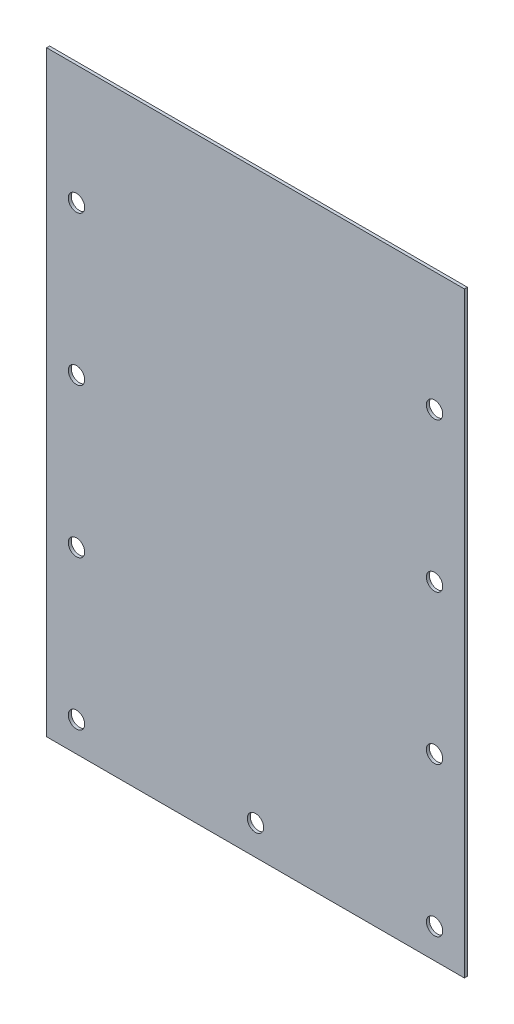
ISO-10303-21;
HEADER;
FILE_DESCRIPTION(('STEP AP214'),'2;1');
FILE_NAME('part.step','',(''),(''),'','','');
FILE_SCHEMA(('AUTOMOTIVE_DESIGN { 1 0 10303 214 1 1 1 1 }'));
ENDSEC;
DATA;
#1=APPLICATION_CONTEXT('core data for automotive mechanical design processes');
#2=APPLICATION_PROTOCOL_DEFINITION('international standard','automotive_design',2000,#1);
#3=PRODUCT_CONTEXT('',#1,'mechanical');
#4=PRODUCT('Part','Part','',(#3));
#5=PRODUCT_RELATED_PRODUCT_CATEGORY('part','',(#4));
#6=PRODUCT_DEFINITION_FORMATION('','',#4);
#7=PRODUCT_DEFINITION_CONTEXT('part definition',#1,'design');
#8=PRODUCT_DEFINITION('design','',#6,#7);
#9=PRODUCT_DEFINITION_SHAPE('','',#8);
#10=(LENGTH_UNIT() NAMED_UNIT(*) SI_UNIT(.MILLI.,.METRE.));
#11=(NAMED_UNIT(*) PLANE_ANGLE_UNIT() SI_UNIT($,.RADIAN.));
#12=(NAMED_UNIT(*) SI_UNIT($,.STERADIAN.) SOLID_ANGLE_UNIT());
#13=UNCERTAINTY_MEASURE_WITH_UNIT(LENGTH_MEASURE(1.E-05),#10,'distance_accuracy_value','');
#14=(GEOMETRIC_REPRESENTATION_CONTEXT(3) GLOBAL_UNCERTAINTY_ASSIGNED_CONTEXT((#13)) GLOBAL_UNIT_ASSIGNED_CONTEXT((#10,
#11,#12)) REPRESENTATION_CONTEXT('',''));
#15=CARTESIAN_POINT('',(0.,0.,0.));
#16=DIRECTION('',(0.,0.,1.));
#17=DIRECTION('',(1.,0.,0.));
#18=AXIS2_PLACEMENT_3D('',#15,#16,#17);
#19=CARTESIAN_POINT('',(-70.,-110.,1.));
#20=DIRECTION('',(-1.,0.,0.));
#21=DIRECTION('',(0.,0.,1.));
#22=AXIS2_PLACEMENT_3D('',#19,#20,#21);
#23=PLANE('',#22);
#24=DIRECTION('',(0.,0.,-1.));
#25=VECTOR('',#24,1.);
#26=CARTESIAN_POINT('',(-70.,90.,10.));
#27=LINE('',#26,#25);
#28=CARTESIAN_POINT('',(-70.,90.,0.999999999999999));
#29=VERTEX_POINT('',#28);
#30=CARTESIAN_POINT('',(-70.,90.,0.));
#31=VERTEX_POINT('',#30);
#32=EDGE_CURVE('E89',#29,#31,#27,.T.);
#33=ORIENTED_EDGE('',*,*,#32,.T.);
#34=DIRECTION('',(0.,1.,0.));
#35=VECTOR('',#34,1.);
#36=CARTESIAN_POINT('',(-70.,-110.,0.));
#37=LINE('',#36,#35);
#38=CARTESIAN_POINT('',(-70.,-110.,0.));
#39=VERTEX_POINT('',#38);
#40=EDGE_CURVE('E82',#39,#31,#37,.T.);
#41=ORIENTED_EDGE('',*,*,#40,.F.);
#42=DIRECTION('',(0.,0.,-1.));
#43=VECTOR('',#42,1.);
#44=CARTESIAN_POINT('',(-70.,-110.,1.));
#45=LINE('',#44,#43);
#46=CARTESIAN_POINT('',(-70.,-110.,1.));
#47=VERTEX_POINT('',#46);
#48=EDGE_CURVE('E11',#47,#39,#45,.T.);
#49=ORIENTED_EDGE('',*,*,#48,.F.);
#50=DIRECTION('',(0.,1.,0.));
#51=VECTOR('',#50,1.);
#52=CARTESIAN_POINT('',(-70.,-110.,1.));
#53=LINE('',#52,#51);
#54=EDGE_CURVE('E85',#47,#29,#53,.T.);
#55=ORIENTED_EDGE('',*,*,#54,.T.);
#56=EDGE_LOOP('',(#33,#41,#49,#55));
#57=FACE_BOUND('',#56,.T.);
#58=ADVANCED_FACE('F37',(#57),#23,.T.);
#59=CARTESIAN_POINT('',(-70.,-110.,1.));
#60=DIRECTION('',(0.,1.,0.));
#61=DIRECTION('',(0.,0.,1.));
#62=AXIS2_PLACEMENT_3D('',#59,#60,#61);
#63=PLANE('',#62);
#64=DIRECTION('',(1.,0.,0.));
#65=VECTOR('',#64,1.);
#66=CARTESIAN_POINT('',(-70.,-110.,0.));
#67=LINE('',#66,#65);
#68=CARTESIAN_POINT('',(70.,-110.,0.));
#69=VERTEX_POINT('',#68);
#70=EDGE_CURVE('E72',#39,#69,#67,.T.);
#71=ORIENTED_EDGE('',*,*,#70,.T.);
#72=DIRECTION('',(0.,0.,-1.));
#73=VECTOR('',#72,1.);
#74=CARTESIAN_POINT('',(70.,-110.,1.));
#75=LINE('',#74,#73);
#76=CARTESIAN_POINT('',(70.,-110.,1.));
#77=VERTEX_POINT('',#76);
#78=EDGE_CURVE('E40',#77,#69,#75,.T.);
#79=ORIENTED_EDGE('',*,*,#78,.F.);
#80=DIRECTION('',(1.,0.,0.));
#81=VECTOR('',#80,1.);
#82=CARTESIAN_POINT('',(-70.,-110.,1.));
#83=LINE('',#82,#81);
#84=EDGE_CURVE('E74',#47,#77,#83,.T.);
#85=ORIENTED_EDGE('',*,*,#84,.F.);
#86=ORIENTED_EDGE('',*,*,#48,.T.);
#87=EDGE_LOOP('',(#71,#79,#85,#86));
#88=FACE_BOUND('',#87,.T.);
#89=ADVANCED_FACE('F70',(#88),#63,.F.);
#90=CARTESIAN_POINT('',(70.,-110.,1.));
#91=DIRECTION('',(-1.,0.,0.));
#92=DIRECTION('',(0.,0.,1.));
#93=AXIS2_PLACEMENT_3D('',#90,#91,#92);
#94=PLANE('',#93);
#95=DIRECTION('',(0.,1.,0.));
#96=VECTOR('',#95,1.);
#97=CARTESIAN_POINT('',(70.,-110.,0.));
#98=LINE('',#97,#96);
#99=CARTESIAN_POINT('',(70.,90.,0.));
#100=VERTEX_POINT('',#99);
#101=EDGE_CURVE('E84',#69,#100,#98,.T.);
#102=ORIENTED_EDGE('',*,*,#101,.T.);
#103=DIRECTION('',(0.,0.,-1.));
#104=VECTOR('',#103,1.);
#105=CARTESIAN_POINT('',(70.,90.,10.));
#106=LINE('',#105,#104);
#107=CARTESIAN_POINT('',(70.,90.,0.999999999999999));
#108=VERTEX_POINT('',#107);
#109=EDGE_CURVE('E51',#108,#100,#106,.T.);
#110=ORIENTED_EDGE('',*,*,#109,.F.);
#111=DIRECTION('',(0.,1.,0.));
#112=VECTOR('',#111,1.);
#113=CARTESIAN_POINT('',(70.,-110.,1.));
#114=LINE('',#113,#112);
#115=EDGE_CURVE('E98',#77,#108,#114,.T.);
#116=ORIENTED_EDGE('',*,*,#115,.F.);
#117=ORIENTED_EDGE('',*,*,#78,.T.);
#118=EDGE_LOOP('',(#102,#110,#116,#117));
#119=FACE_BOUND('',#118,.T.);
#120=ADVANCED_FACE('F162',(#119),#94,.F.);
#121=CARTESIAN_POINT('',(0.,0.,1.));
#122=DIRECTION('',(0.,0.,-1.));
#123=DIRECTION('',(-1.,0.,0.));
#124=AXIS2_PLACEMENT_3D('',#121,#122,#123);
#125=PLANE('',#124);
#126=CARTESIAN_POINT('',(-60.,50.,1.));
#127=DIRECTION('',(0.,0.,-1.));
#128=DIRECTION('',(-1.,0.,0.));
#129=AXIS2_PLACEMENT_3D('',#126,#127,#128);
#130=CIRCLE('',#129,2.75);
#131=CARTESIAN_POINT('',(-62.75,50.,1.));
#132=VERTEX_POINT('',#131);
#133=EDGE_CURVE('E146',#132,#132,#130,.T.);
#134=ORIENTED_EDGE('',*,*,#133,.T.);
#135=EDGE_LOOP('',(#134));
#136=FACE_BOUND('',#135,.T.);
#137=CARTESIAN_POINT('',(-60.,-50.,1.));
#138=DIRECTION('',(0.,0.,-1.));
#139=DIRECTION('',(-1.,0.,0.));
#140=AXIS2_PLACEMENT_3D('',#137,#138,#139);
#141=CIRCLE('',#140,2.75);
#142=CARTESIAN_POINT('',(-62.75,-50.,1.));
#143=VERTEX_POINT('',#142);
#144=EDGE_CURVE('E140',#143,#143,#141,.T.);
#145=ORIENTED_EDGE('',*,*,#144,.T.);
#146=EDGE_LOOP('',(#145));
#147=FACE_BOUND('',#146,.T.);
#148=CARTESIAN_POINT('',(-60.,0.,1.));
#149=DIRECTION('',(0.,0.,-1.));
#150=DIRECTION('',(-1.,0.,0.));
#151=AXIS2_PLACEMENT_3D('',#148,#149,#150);
#152=CIRCLE('',#151,2.75);
#153=CARTESIAN_POINT('',(-62.75,0.,1.));
#154=VERTEX_POINT('',#153);
#155=EDGE_CURVE('E134',#154,#154,#152,.T.);
#156=ORIENTED_EDGE('',*,*,#155,.T.);
#157=EDGE_LOOP('',(#156));
#158=FACE_BOUND('',#157,.T.);
#159=CARTESIAN_POINT('',(-60.,-100.,1.));
#160=DIRECTION('',(0.,0.,-1.));
#161=DIRECTION('',(-1.,0.,0.));
#162=AXIS2_PLACEMENT_3D('',#159,#160,#161);
#163=CIRCLE('',#162,2.75);
#164=CARTESIAN_POINT('',(-62.75,-100.,1.));
#165=VERTEX_POINT('',#164);
#166=EDGE_CURVE('E128',#165,#165,#163,.T.);
#167=ORIENTED_EDGE('',*,*,#166,.T.);
#168=EDGE_LOOP('',(#167));
#169=FACE_BOUND('',#168,.T.);
#170=CARTESIAN_POINT('',(60.,50.,1.));
#171=DIRECTION('',(0.,0.,-1.));
#172=DIRECTION('',(-1.,0.,0.));
#173=AXIS2_PLACEMENT_3D('',#170,#171,#172);
#174=CIRCLE('',#173,2.75);
#175=CARTESIAN_POINT('',(57.25,50.,1.));
#176=VERTEX_POINT('',#175);
#177=EDGE_CURVE('E122',#176,#176,#174,.T.);
#178=ORIENTED_EDGE('',*,*,#177,.T.);
#179=EDGE_LOOP('',(#178));
#180=FACE_BOUND('',#179,.T.);
#181=CARTESIAN_POINT('',(60.,-50.,1.));
#182=DIRECTION('',(0.,0.,-1.));
#183=DIRECTION('',(-1.,0.,0.));
#184=AXIS2_PLACEMENT_3D('',#181,#182,#183);
#185=CIRCLE('',#184,2.75);
#186=CARTESIAN_POINT('',(57.25,-50.,1.));
#187=VERTEX_POINT('',#186);
#188=EDGE_CURVE('E116',#187,#187,#185,.T.);
#189=ORIENTED_EDGE('',*,*,#188,.T.);
#190=EDGE_LOOP('',(#189));
#191=FACE_BOUND('',#190,.T.);
#192=CARTESIAN_POINT('',(60.,0.,1.));
#193=DIRECTION('',(0.,0.,-1.));
#194=DIRECTION('',(-1.,0.,0.));
#195=AXIS2_PLACEMENT_3D('',#192,#193,#194);
#196=CIRCLE('',#195,2.75);
#197=CARTESIAN_POINT('',(57.25,0.,1.));
#198=VERTEX_POINT('',#197);
#199=EDGE_CURVE('E110',#198,#198,#196,.T.);
#200=ORIENTED_EDGE('',*,*,#199,.T.);
#201=EDGE_LOOP('',(#200));
#202=FACE_BOUND('',#201,.T.);
#203=CARTESIAN_POINT('',(60.,-100.,1.));
#204=DIRECTION('',(0.,0.,-1.));
#205=DIRECTION('',(-1.,0.,0.));
#206=AXIS2_PLACEMENT_3D('',#203,#204,#205);
#207=CIRCLE('',#206,2.75);
#208=CARTESIAN_POINT('',(57.25,-100.,1.));
#209=VERTEX_POINT('',#208);
#210=EDGE_CURVE('E104',#209,#209,#207,.T.);
#211=ORIENTED_EDGE('',*,*,#210,.T.);
#212=EDGE_LOOP('',(#211));
#213=FACE_BOUND('',#212,.T.);
#214=CARTESIAN_POINT('',(0.,-100.,1.));
#215=DIRECTION('',(0.,0.,-1.));
#216=DIRECTION('',(-1.,0.,0.));
#217=AXIS2_PLACEMENT_3D('',#214,#215,#216);
#218=CIRCLE('',#217,2.75);
#219=CARTESIAN_POINT('',(-2.74999999999999,-100.,1.));
#220=VERTEX_POINT('',#219);
#221=EDGE_CURVE('E90',#220,#220,#218,.T.);
#222=ORIENTED_EDGE('',*,*,#221,.T.);
#223=EDGE_LOOP('',(#222));
#224=FACE_BOUND('',#223,.T.);
#225=ORIENTED_EDGE('',*,*,#115,.T.);
#226=DIRECTION('',(-1.,0.,0.));
#227=VECTOR('',#226,1.);
#228=CARTESIAN_POINT('',(0.,90.,1.));
#229=LINE('',#228,#227);
#230=EDGE_CURVE('E152',#108,#29,#229,.T.);
#231=ORIENTED_EDGE('',*,*,#230,.T.);
#232=ORIENTED_EDGE('',*,*,#54,.F.);
#233=ORIENTED_EDGE('',*,*,#84,.T.);
#234=EDGE_LOOP('',(#225,#231,#232,#233));
#235=FACE_BOUND('',#234,.T.);
#236=ADVANCED_FACE('F165',(#136,#147,#158,#169,#180,#191,#202,#213,#224,#235),#125,.F.);
#237=CARTESIAN_POINT('',(0.,0.,0.));
#238=DIRECTION('',(0.,0.,-1.));
#239=DIRECTION('',(-1.,0.,0.));
#240=AXIS2_PLACEMENT_3D('',#237,#238,#239);
#241=PLANE('',#240);
#242=DIRECTION('',(-1.,0.,0.));
#243=VECTOR('',#242,1.);
#244=CARTESIAN_POINT('',(70.,90.,0.));
#245=LINE('',#244,#243);
#246=EDGE_CURVE('E156',#100,#31,#245,.T.);
#247=ORIENTED_EDGE('',*,*,#246,.F.);
#248=ORIENTED_EDGE('',*,*,#101,.F.);
#249=ORIENTED_EDGE('',*,*,#70,.F.);
#250=ORIENTED_EDGE('',*,*,#40,.T.);
#251=EDGE_LOOP('',(#247,#248,#249,#250));
#252=FACE_BOUND('',#251,.T.);
#253=CARTESIAN_POINT('',(-60.,50.,0.));
#254=DIRECTION('',(0.,0.,-1.));
#255=DIRECTION('',(-1.,0.,0.));
#256=AXIS2_PLACEMENT_3D('',#253,#254,#255);
#257=CIRCLE('',#256,2.75);
#258=CARTESIAN_POINT('',(-62.75,50.,0.));
#259=VERTEX_POINT('',#258);
#260=EDGE_CURVE('E149',#259,#259,#257,.T.);
#261=ORIENTED_EDGE('',*,*,#260,.F.);
#262=EDGE_LOOP('',(#261));
#263=FACE_BOUND('',#262,.T.);
#264=CARTESIAN_POINT('',(-60.,-50.,0.));
#265=DIRECTION('',(0.,0.,-1.));
#266=DIRECTION('',(-1.,0.,0.));
#267=AXIS2_PLACEMENT_3D('',#264,#265,#266);
#268=CIRCLE('',#267,2.75);
#269=CARTESIAN_POINT('',(-62.75,-50.,0.));
#270=VERTEX_POINT('',#269);
#271=EDGE_CURVE('E143',#270,#270,#268,.T.);
#272=ORIENTED_EDGE('',*,*,#271,.F.);
#273=EDGE_LOOP('',(#272));
#274=FACE_BOUND('',#273,.T.);
#275=CARTESIAN_POINT('',(-60.,0.,0.));
#276=DIRECTION('',(0.,0.,-1.));
#277=DIRECTION('',(-1.,0.,0.));
#278=AXIS2_PLACEMENT_3D('',#275,#276,#277);
#279=CIRCLE('',#278,2.75);
#280=CARTESIAN_POINT('',(-62.75,0.,0.));
#281=VERTEX_POINT('',#280);
#282=EDGE_CURVE('E137',#281,#281,#279,.T.);
#283=ORIENTED_EDGE('',*,*,#282,.F.);
#284=EDGE_LOOP('',(#283));
#285=FACE_BOUND('',#284,.T.);
#286=CARTESIAN_POINT('',(-60.,-100.,0.));
#287=DIRECTION('',(0.,0.,-1.));
#288=DIRECTION('',(-1.,0.,0.));
#289=AXIS2_PLACEMENT_3D('',#286,#287,#288);
#290=CIRCLE('',#289,2.75);
#291=CARTESIAN_POINT('',(-62.75,-100.,0.));
#292=VERTEX_POINT('',#291);
#293=EDGE_CURVE('E131',#292,#292,#290,.T.);
#294=ORIENTED_EDGE('',*,*,#293,.F.);
#295=EDGE_LOOP('',(#294));
#296=FACE_BOUND('',#295,.T.);
#297=CARTESIAN_POINT('',(60.,50.,0.));
#298=DIRECTION('',(0.,0.,-1.));
#299=DIRECTION('',(-1.,0.,0.));
#300=AXIS2_PLACEMENT_3D('',#297,#298,#299);
#301=CIRCLE('',#300,2.75);
#302=CARTESIAN_POINT('',(57.25,50.,0.));
#303=VERTEX_POINT('',#302);
#304=EDGE_CURVE('E125',#303,#303,#301,.T.);
#305=ORIENTED_EDGE('',*,*,#304,.F.);
#306=EDGE_LOOP('',(#305));
#307=FACE_BOUND('',#306,.T.);
#308=CARTESIAN_POINT('',(60.,-50.,0.));
#309=DIRECTION('',(0.,0.,-1.));
#310=DIRECTION('',(-1.,0.,0.));
#311=AXIS2_PLACEMENT_3D('',#308,#309,#310);
#312=CIRCLE('',#311,2.75);
#313=CARTESIAN_POINT('',(57.25,-50.,0.));
#314=VERTEX_POINT('',#313);
#315=EDGE_CURVE('E119',#314,#314,#312,.T.);
#316=ORIENTED_EDGE('',*,*,#315,.F.);
#317=EDGE_LOOP('',(#316));
#318=FACE_BOUND('',#317,.T.);
#319=CARTESIAN_POINT('',(60.,0.,0.));
#320=DIRECTION('',(0.,0.,-1.));
#321=DIRECTION('',(-1.,0.,0.));
#322=AXIS2_PLACEMENT_3D('',#319,#320,#321);
#323=CIRCLE('',#322,2.75);
#324=CARTESIAN_POINT('',(57.25,0.,0.));
#325=VERTEX_POINT('',#324);
#326=EDGE_CURVE('E113',#325,#325,#323,.T.);
#327=ORIENTED_EDGE('',*,*,#326,.F.);
#328=EDGE_LOOP('',(#327));
#329=FACE_BOUND('',#328,.T.);
#330=CARTESIAN_POINT('',(60.,-100.,0.));
#331=DIRECTION('',(0.,0.,-1.));
#332=DIRECTION('',(-1.,0.,0.));
#333=AXIS2_PLACEMENT_3D('',#330,#331,#332);
#334=CIRCLE('',#333,2.75);
#335=CARTESIAN_POINT('',(57.25,-100.,0.));
#336=VERTEX_POINT('',#335);
#337=EDGE_CURVE('E107',#336,#336,#334,.T.);
#338=ORIENTED_EDGE('',*,*,#337,.F.);
#339=EDGE_LOOP('',(#338));
#340=FACE_BOUND('',#339,.T.);
#341=CARTESIAN_POINT('',(0.,-100.,0.));
#342=DIRECTION('',(0.,0.,-1.));
#343=DIRECTION('',(-1.,0.,0.));
#344=AXIS2_PLACEMENT_3D('',#341,#342,#343);
#345=CIRCLE('',#344,2.75);
#346=CARTESIAN_POINT('',(-2.74999999999999,-100.,0.));
#347=VERTEX_POINT('',#346);
#348=EDGE_CURVE('E94',#347,#347,#345,.T.);
#349=ORIENTED_EDGE('',*,*,#348,.F.);
#350=EDGE_LOOP('',(#349));
#351=FACE_BOUND('',#350,.T.);
#352=ADVANCED_FACE('F79',(#252,#263,#274,#285,#296,#307,#318,#329,#340,#351),#241,.T.);
#353=CARTESIAN_POINT('',(0.,-100.,0.));
#354=DIRECTION('',(0.,0.,-1.));
#355=DIRECTION('',(-1.,0.,0.));
#356=AXIS2_PLACEMENT_3D('',#353,#354,#355);
#357=CYLINDRICAL_SURFACE('',#356,2.75);
#358=ORIENTED_EDGE('',*,*,#221,.F.);
#359=EDGE_LOOP('',(#358));
#360=FACE_BOUND('',#359,.T.);
#361=ORIENTED_EDGE('',*,*,#348,.T.);
#362=EDGE_LOOP('',(#361));
#363=FACE_BOUND('',#362,.T.);
#364=ADVANCED_FACE('F174',(#360,#363),#357,.F.);
#365=CARTESIAN_POINT('',(60.,-100.,0.));
#366=DIRECTION('',(0.,0.,-1.));
#367=DIRECTION('',(-1.,0.,0.));
#368=AXIS2_PLACEMENT_3D('',#365,#366,#367);
#369=CYLINDRICAL_SURFACE('',#368,2.75);
#370=ORIENTED_EDGE('',*,*,#210,.F.);
#371=EDGE_LOOP('',(#370));
#372=FACE_BOUND('',#371,.T.);
#373=ORIENTED_EDGE('',*,*,#337,.T.);
#374=EDGE_LOOP('',(#373));
#375=FACE_BOUND('',#374,.T.);
#376=ADVANCED_FACE('F273',(#372,#375),#369,.F.);
#377=CARTESIAN_POINT('',(60.,0.,0.));
#378=DIRECTION('',(0.,0.,-1.));
#379=DIRECTION('',(-1.,0.,0.));
#380=AXIS2_PLACEMENT_3D('',#377,#378,#379);
#381=CYLINDRICAL_SURFACE('',#380,2.75);
#382=ORIENTED_EDGE('',*,*,#199,.F.);
#383=EDGE_LOOP('',(#382));
#384=FACE_BOUND('',#383,.T.);
#385=ORIENTED_EDGE('',*,*,#326,.T.);
#386=EDGE_LOOP('',(#385));
#387=FACE_BOUND('',#386,.T.);
#388=ADVANCED_FACE('F265',(#384,#387),#381,.F.);
#389=CARTESIAN_POINT('',(60.,-50.,0.));
#390=DIRECTION('',(0.,0.,-1.));
#391=DIRECTION('',(-1.,0.,0.));
#392=AXIS2_PLACEMENT_3D('',#389,#390,#391);
#393=CYLINDRICAL_SURFACE('',#392,2.75);
#394=ORIENTED_EDGE('',*,*,#188,.F.);
#395=EDGE_LOOP('',(#394));
#396=FACE_BOUND('',#395,.T.);
#397=ORIENTED_EDGE('',*,*,#315,.T.);
#398=EDGE_LOOP('',(#397));
#399=FACE_BOUND('',#398,.T.);
#400=ADVANCED_FACE('F257',(#396,#399),#393,.F.);
#401=CARTESIAN_POINT('',(60.,50.,0.));
#402=DIRECTION('',(0.,0.,-1.));
#403=DIRECTION('',(-1.,0.,0.));
#404=AXIS2_PLACEMENT_3D('',#401,#402,#403);
#405=CYLINDRICAL_SURFACE('',#404,2.75);
#406=ORIENTED_EDGE('',*,*,#177,.F.);
#407=EDGE_LOOP('',(#406));
#408=FACE_BOUND('',#407,.T.);
#409=ORIENTED_EDGE('',*,*,#304,.T.);
#410=EDGE_LOOP('',(#409));
#411=FACE_BOUND('',#410,.T.);
#412=ADVANCED_FACE('F249',(#408,#411),#405,.F.);
#413=CARTESIAN_POINT('',(-60.,-100.,0.));
#414=DIRECTION('',(0.,0.,-1.));
#415=DIRECTION('',(-1.,0.,0.));
#416=AXIS2_PLACEMENT_3D('',#413,#414,#415);
#417=CYLINDRICAL_SURFACE('',#416,2.75);
#418=ORIENTED_EDGE('',*,*,#166,.F.);
#419=EDGE_LOOP('',(#418));
#420=FACE_BOUND('',#419,.T.);
#421=ORIENTED_EDGE('',*,*,#293,.T.);
#422=EDGE_LOOP('',(#421));
#423=FACE_BOUND('',#422,.T.);
#424=ADVANCED_FACE('F241',(#420,#423),#417,.F.);
#425=CARTESIAN_POINT('',(-60.,0.,0.));
#426=DIRECTION('',(0.,0.,-1.));
#427=DIRECTION('',(-1.,0.,0.));
#428=AXIS2_PLACEMENT_3D('',#425,#426,#427);
#429=CYLINDRICAL_SURFACE('',#428,2.75);
#430=ORIENTED_EDGE('',*,*,#155,.F.);
#431=EDGE_LOOP('',(#430));
#432=FACE_BOUND('',#431,.T.);
#433=ORIENTED_EDGE('',*,*,#282,.T.);
#434=EDGE_LOOP('',(#433));
#435=FACE_BOUND('',#434,.T.);
#436=ADVANCED_FACE('F233',(#432,#435),#429,.F.);
#437=CARTESIAN_POINT('',(-60.,-50.,0.));
#438=DIRECTION('',(0.,0.,-1.));
#439=DIRECTION('',(-1.,0.,0.));
#440=AXIS2_PLACEMENT_3D('',#437,#438,#439);
#441=CYLINDRICAL_SURFACE('',#440,2.75);
#442=ORIENTED_EDGE('',*,*,#144,.F.);
#443=EDGE_LOOP('',(#442));
#444=FACE_BOUND('',#443,.T.);
#445=ORIENTED_EDGE('',*,*,#271,.T.);
#446=EDGE_LOOP('',(#445));
#447=FACE_BOUND('',#446,.T.);
#448=ADVANCED_FACE('F226',(#444,#447),#441,.F.);
#449=CARTESIAN_POINT('',(-60.,50.,0.));
#450=DIRECTION('',(0.,0.,-1.));
#451=DIRECTION('',(-1.,0.,0.));
#452=AXIS2_PLACEMENT_3D('',#449,#450,#451);
#453=CYLINDRICAL_SURFACE('',#452,2.75);
#454=ORIENTED_EDGE('',*,*,#133,.F.);
#455=EDGE_LOOP('',(#454));
#456=FACE_BOUND('',#455,.T.);
#457=ORIENTED_EDGE('',*,*,#260,.T.);
#458=EDGE_LOOP('',(#457));
#459=FACE_BOUND('',#458,.T.);
#460=ADVANCED_FACE('F216',(#456,#459),#453,.F.);
#461=CARTESIAN_POINT('',(70.,90.,10.));
#462=DIRECTION('',(0.,-1.,0.));
#463=DIRECTION('',(0.,0.,-1.));
#464=AXIS2_PLACEMENT_3D('',#461,#462,#463);
#465=PLANE('',#464);
#466=ORIENTED_EDGE('',*,*,#109,.T.);
#467=ORIENTED_EDGE('',*,*,#246,.T.);
#468=ORIENTED_EDGE('',*,*,#32,.F.);
#469=ORIENTED_EDGE('',*,*,#230,.F.);
#470=EDGE_LOOP('',(#466,#467,#468,#469));
#471=FACE_BOUND('',#470,.T.);
#472=ADVANCED_FACE('F158',(#471),#465,.F.);
#473=CLOSED_SHELL('',(#58,#89,#120,#236,#352,#364,#376,#388,#400,#412,#424,#436,#448,#460,#472));
#474=MANIFOLD_SOLID_BREP('B2',#473);
#475=ADVANCED_BREP_SHAPE_REPRESENTATION('',(#18,#474),#14);
#476=SHAPE_DEFINITION_REPRESENTATION(#9,#475);
ENDSEC;
END-ISO-10303-21;
